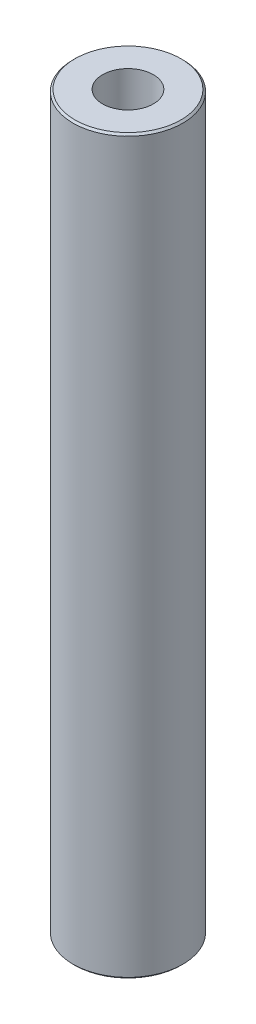
ISO-10303-21;
HEADER;
FILE_DESCRIPTION(('STEP AP214'),'2;1');
FILE_NAME('part.step','',(''),(''),'','','');
FILE_SCHEMA(('AUTOMOTIVE_DESIGN { 1 0 10303 214 1 1 1 1 }'));
ENDSEC;
DATA;
#1=APPLICATION_CONTEXT('core data for automotive mechanical design processes');
#2=APPLICATION_PROTOCOL_DEFINITION('international standard','automotive_design',2000,#1);
#3=PRODUCT_CONTEXT('',#1,'mechanical');
#4=PRODUCT('Part','Part','',(#3));
#5=PRODUCT_RELATED_PRODUCT_CATEGORY('part','',(#4));
#6=PRODUCT_DEFINITION_FORMATION('','',#4);
#7=PRODUCT_DEFINITION_CONTEXT('part definition',#1,'design');
#8=PRODUCT_DEFINITION('design','',#6,#7);
#9=PRODUCT_DEFINITION_SHAPE('','',#8);
#10=(LENGTH_UNIT() NAMED_UNIT(*) SI_UNIT(.MILLI.,.METRE.));
#11=(NAMED_UNIT(*) PLANE_ANGLE_UNIT() SI_UNIT($,.RADIAN.));
#12=(NAMED_UNIT(*) SI_UNIT($,.STERADIAN.) SOLID_ANGLE_UNIT());
#13=UNCERTAINTY_MEASURE_WITH_UNIT(LENGTH_MEASURE(1.E-05),#10,'distance_accuracy_value','');
#14=(GEOMETRIC_REPRESENTATION_CONTEXT(3) GLOBAL_UNCERTAINTY_ASSIGNED_CONTEXT((#13)) GLOBAL_UNIT_ASSIGNED_CONTEXT((#10,
#11,#12)) REPRESENTATION_CONTEXT('',''));
#15=CARTESIAN_POINT('',(0.,0.,0.));
#16=DIRECTION('',(0.,0.,1.));
#17=DIRECTION('',(1.,0.,0.));
#18=AXIS2_PLACEMENT_3D('',#15,#16,#17);
#19=CARTESIAN_POINT('',(0.,600.,0.));
#20=DIRECTION('',(0.,-1.,0.));
#21=DIRECTION('',(0.,0.,-1.));
#22=AXIS2_PLACEMENT_3D('',#19,#20,#21);
#23=CYLINDRICAL_SURFACE('',#22,45.);
#24=CARTESIAN_POINT('',(0.,598.45771963681,0.));
#25=DIRECTION('',(0.,1.,0.));
#26=DIRECTION('',(0.,0.,1.));
#27=AXIS2_PLACEMENT_3D('',#24,#25,#26);
#28=CIRCLE('',#27,45.);
#29=CARTESIAN_POINT('',(0.,598.45771963681,45.));
#30=VERTEX_POINT('',#29);
#31=EDGE_CURVE('E50',#30,#30,#28,.F.);
#32=ORIENTED_EDGE('',*,*,#31,.T.);
#33=EDGE_LOOP('',(#32));
#34=FACE_BOUND('',#33,.T.);
#35=CARTESIAN_POINT('',(0.,1.54228036318949,0.));
#36=DIRECTION('',(0.,1.,0.));
#37=DIRECTION('',(0.,0.,1.));
#38=AXIS2_PLACEMENT_3D('',#35,#36,#37);
#39=CIRCLE('',#38,45.);
#40=CARTESIAN_POINT('',(0.,1.54228036318949,45.));
#41=VERTEX_POINT('',#40);
#42=EDGE_CURVE('E51',#41,#41,#39,.T.);
#43=ORIENTED_EDGE('',*,*,#42,.T.);
#44=EDGE_LOOP('',(#43));
#45=FACE_BOUND('',#44,.T.);
#46=ADVANCED_FACE('F39',(#34,#45),#23,.T.);
#47=CARTESIAN_POINT('',(0.,600.,0.));
#48=DIRECTION('',(0.,1.,0.));
#49=DIRECTION('',(0.,0.,1.));
#50=AXIS2_PLACEMENT_3D('',#47,#48,#49);
#51=PLANE('',#50);
#52=CARTESIAN_POINT('',(0.,600.,0.));
#53=DIRECTION('',(0.,1.,0.));
#54=DIRECTION('',(0.,0.,1.));
#55=AXIS2_PLACEMENT_3D('',#52,#53,#54);
#56=CIRCLE('',#55,43.4577196368106);
#57=CARTESIAN_POINT('',(0.,600.,43.4577196368106));
#58=VERTEX_POINT('',#57);
#59=EDGE_CURVE('E54',#58,#58,#56,.T.);
#60=ORIENTED_EDGE('',*,*,#59,.T.);
#61=EDGE_LOOP('',(#60));
#62=FACE_BOUND('',#61,.T.);
#63=CARTESIAN_POINT('',(0.,600.,0.));
#64=DIRECTION('',(0.,1.,0.));
#65=DIRECTION('',(0.,0.,1.));
#66=AXIS2_PLACEMENT_3D('',#63,#64,#65);
#67=CIRCLE('',#66,20.8063054208763);
#68=CARTESIAN_POINT('',(0.,600.,20.8063054208763));
#69=VERTEX_POINT('',#68);
#70=EDGE_CURVE('E58',#69,#69,#67,.T.);
#71=ORIENTED_EDGE('',*,*,#70,.F.);
#72=EDGE_LOOP('',(#71));
#73=FACE_BOUND('',#72,.T.);
#74=ADVANCED_FACE('F69',(#62,#73),#51,.T.);
#75=CARTESIAN_POINT('',(0.,0.,0.));
#76=DIRECTION('',(0.,1.,0.));
#77=DIRECTION('',(0.,0.,1.));
#78=AXIS2_PLACEMENT_3D('',#75,#76,#77);
#79=PLANE('',#78);
#80=CARTESIAN_POINT('',(0.,0.,0.));
#81=DIRECTION('',(0.,1.,0.));
#82=DIRECTION('',(0.,0.,1.));
#83=AXIS2_PLACEMENT_3D('',#80,#81,#82);
#84=CIRCLE('',#83,43.4577196368105);
#85=CARTESIAN_POINT('',(0.,0.,43.4577196368105));
#86=VERTEX_POINT('',#85);
#87=EDGE_CURVE('E10',#86,#86,#84,.F.);
#88=ORIENTED_EDGE('',*,*,#87,.T.);
#89=EDGE_LOOP('',(#88));
#90=FACE_BOUND('',#89,.T.);
#91=CARTESIAN_POINT('',(0.,0.,0.));
#92=DIRECTION('',(0.,1.,0.));
#93=DIRECTION('',(0.,0.,1.));
#94=AXIS2_PLACEMENT_3D('',#91,#92,#93);
#95=CIRCLE('',#94,20.8063054208763);
#96=CARTESIAN_POINT('',(0.,0.,20.8063054208763));
#97=VERTEX_POINT('',#96);
#98=EDGE_CURVE('E63',#97,#97,#95,.T.);
#99=ORIENTED_EDGE('',*,*,#98,.T.);
#100=EDGE_LOOP('',(#99));
#101=FACE_BOUND('',#100,.T.);
#102=ADVANCED_FACE('F75',(#90,#101),#79,.F.);
#103=CARTESIAN_POINT('',(0.,600.,0.));
#104=DIRECTION('',(0.,-1.,0.));
#105=DIRECTION('',(0.,0.,-1.));
#106=AXIS2_PLACEMENT_3D('',#103,#104,#105);
#107=CYLINDRICAL_SURFACE('',#106,20.8063054208763);
#108=ORIENTED_EDGE('',*,*,#70,.T.);
#109=EDGE_LOOP('',(#108));
#110=FACE_BOUND('',#109,.T.);
#111=ORIENTED_EDGE('',*,*,#98,.F.);
#112=EDGE_LOOP('',(#111));
#113=FACE_BOUND('',#112,.T.);
#114=ADVANCED_FACE('F70',(#110,#113),#107,.F.);
#115=CARTESIAN_POINT('',(0.,600.,0.));
#116=DIRECTION('',(0.,-1.,0.));
#117=DIRECTION('',(0.,0.,-1.));
#118=AXIS2_PLACEMENT_3D('',#115,#116,#117);
#119=CONICAL_SURFACE('',#118,43.4577196368106,0.785398163397419);
#120=ORIENTED_EDGE('',*,*,#31,.F.);
#121=EDGE_LOOP('',(#120));
#122=FACE_BOUND('',#121,.T.);
#123=ORIENTED_EDGE('',*,*,#59,.F.);
#124=EDGE_LOOP('',(#123));
#125=FACE_BOUND('',#124,.T.);
#126=ADVANCED_FACE('F81',(#122,#125),#119,.T.);
#127=CARTESIAN_POINT('',(0.,1.54228036318949,0.));
#128=DIRECTION('',(0.,1.,0.));
#129=DIRECTION('',(0.,0.,1.));
#130=AXIS2_PLACEMENT_3D('',#127,#128,#129);
#131=CONICAL_SURFACE('',#130,45.,0.785398163397457);
#132=ORIENTED_EDGE('',*,*,#87,.F.);
#133=EDGE_LOOP('',(#132));
#134=FACE_BOUND('',#133,.T.);
#135=ORIENTED_EDGE('',*,*,#42,.F.);
#136=EDGE_LOOP('',(#135));
#137=FACE_BOUND('',#136,.T.);
#138=ADVANCED_FACE('F45',(#134,#137),#131,.T.);
#139=CLOSED_SHELL('',(#46,#74,#102,#114,#126,#138));
#140=MANIFOLD_SOLID_BREP('B2',#139);
#141=ADVANCED_BREP_SHAPE_REPRESENTATION('',(#18,#140),#14);
#142=SHAPE_DEFINITION_REPRESENTATION(#9,#141);
ENDSEC;
END-ISO-10303-21;
